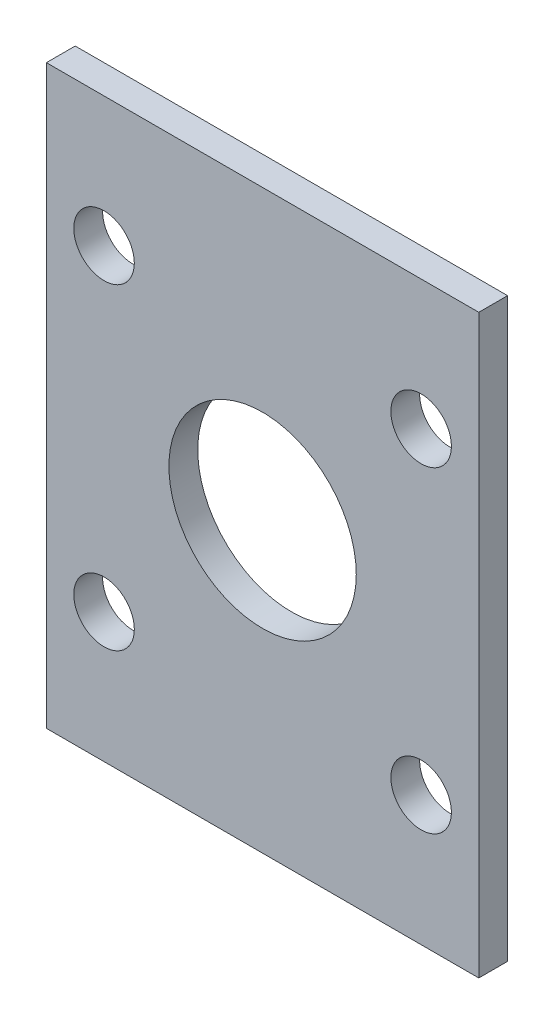
ISO-10303-21;
HEADER;
FILE_DESCRIPTION(('STEP AP214'),'2;1');
FILE_NAME('part.step','',(''),(''),'','','');
FILE_SCHEMA(('AUTOMOTIVE_DESIGN { 1 0 10303 214 1 1 1 1 }'));
ENDSEC;
DATA;
#1=APPLICATION_CONTEXT('core data for automotive mechanical design processes');
#2=APPLICATION_PROTOCOL_DEFINITION('international standard','automotive_design',2000,#1);
#3=PRODUCT_CONTEXT('',#1,'mechanical');
#4=PRODUCT('Part','Part','',(#3));
#5=PRODUCT_RELATED_PRODUCT_CATEGORY('part','',(#4));
#6=PRODUCT_DEFINITION_FORMATION('','',#4);
#7=PRODUCT_DEFINITION_CONTEXT('part definition',#1,'design');
#8=PRODUCT_DEFINITION('design','',#6,#7);
#9=PRODUCT_DEFINITION_SHAPE('','',#8);
#10=(LENGTH_UNIT() NAMED_UNIT(*) SI_UNIT(.MILLI.,.METRE.));
#11=(NAMED_UNIT(*) PLANE_ANGLE_UNIT() SI_UNIT($,.RADIAN.));
#12=(NAMED_UNIT(*) SI_UNIT($,.STERADIAN.) SOLID_ANGLE_UNIT());
#13=UNCERTAINTY_MEASURE_WITH_UNIT(LENGTH_MEASURE(1.E-05),#10,'distance_accuracy_value','');
#14=(GEOMETRIC_REPRESENTATION_CONTEXT(3) GLOBAL_UNCERTAINTY_ASSIGNED_CONTEXT((#13)) GLOBAL_UNIT_ASSIGNED_CONTEXT((#10,
#11,#12)) REPRESENTATION_CONTEXT('',''));
#15=CARTESIAN_POINT('',(0.,0.,0.));
#16=DIRECTION('',(0.,0.,1.));
#17=DIRECTION('',(1.,0.,0.));
#18=AXIS2_PLACEMENT_3D('',#15,#16,#17);
#19=CARTESIAN_POINT('',(-15.,0.,2.));
#20=DIRECTION('',(1.,0.,0.));
#21=DIRECTION('',(0.,1.,0.));
#22=AXIS2_PLACEMENT_3D('',#19,#20,#21);
#23=PLANE('',#22);
#24=DIRECTION('',(0.,-1.,0.));
#25=VECTOR('',#24,1.);
#26=CARTESIAN_POINT('',(-15.,0.,0.));
#27=LINE('',#26,#25);
#28=CARTESIAN_POINT('',(-15.,20.,0.));
#29=VERTEX_POINT('',#28);
#30=CARTESIAN_POINT('',(-15.,-20.,0.));
#31=VERTEX_POINT('',#30);
#32=EDGE_CURVE('E59',#29,#31,#27,.T.);
#33=ORIENTED_EDGE('',*,*,#32,.T.);
#34=DIRECTION('',(0.,0.,-1.));
#35=VECTOR('',#34,1.);
#36=CARTESIAN_POINT('',(-15.,-20.,0.));
#37=LINE('',#36,#35);
#38=CARTESIAN_POINT('',(-15.,-20.,2.));
#39=VERTEX_POINT('',#38);
#40=EDGE_CURVE('E86',#39,#31,#37,.T.);
#41=ORIENTED_EDGE('',*,*,#40,.F.);
#42=DIRECTION('',(0.,-1.,0.));
#43=VECTOR('',#42,1.);
#44=CARTESIAN_POINT('',(-15.,0.,2.));
#45=LINE('',#44,#43);
#46=CARTESIAN_POINT('',(-15.,20.,2.));
#47=VERTEX_POINT('',#46);
#48=EDGE_CURVE('E51',#47,#39,#45,.T.);
#49=ORIENTED_EDGE('',*,*,#48,.F.);
#50=DIRECTION('',(0.,0.,1.));
#51=VECTOR('',#50,1.);
#52=CARTESIAN_POINT('',(-15.,20.,0.));
#53=LINE('',#52,#51);
#54=EDGE_CURVE('E88',#29,#47,#53,.T.);
#55=ORIENTED_EDGE('',*,*,#54,.F.);
#56=EDGE_LOOP('',(#33,#41,#49,#55));
#57=FACE_BOUND('',#56,.T.);
#58=ADVANCED_FACE('F41',(#57),#23,.F.);
#59=CARTESIAN_POINT('',(15.,0.,2.));
#60=DIRECTION('',(1.,0.,0.));
#61=DIRECTION('',(0.,1.,0.));
#62=AXIS2_PLACEMENT_3D('',#59,#60,#61);
#63=PLANE('',#62);
#64=DIRECTION('',(0.,-1.,0.));
#65=VECTOR('',#64,1.);
#66=CARTESIAN_POINT('',(15.,0.,0.));
#67=LINE('',#66,#65);
#68=CARTESIAN_POINT('',(15.,20.,0.));
#69=VERTEX_POINT('',#68);
#70=CARTESIAN_POINT('',(15.,-20.,0.));
#71=VERTEX_POINT('',#70);
#72=EDGE_CURVE('E45',#69,#71,#67,.T.);
#73=ORIENTED_EDGE('',*,*,#72,.F.);
#74=DIRECTION('',(0.,0.,-1.));
#75=VECTOR('',#74,1.);
#76=CARTESIAN_POINT('',(15.,20.,0.));
#77=LINE('',#76,#75);
#78=CARTESIAN_POINT('',(15.,20.,2.));
#79=VERTEX_POINT('',#78);
#80=EDGE_CURVE('E116',#79,#69,#77,.T.);
#81=ORIENTED_EDGE('',*,*,#80,.F.);
#82=DIRECTION('',(0.,-1.,0.));
#83=VECTOR('',#82,1.);
#84=CARTESIAN_POINT('',(15.,0.,2.));
#85=LINE('',#84,#83);
#86=CARTESIAN_POINT('',(15.,-20.,2.));
#87=VERTEX_POINT('',#86);
#88=EDGE_CURVE('E11',#79,#87,#85,.T.);
#89=ORIENTED_EDGE('',*,*,#88,.T.);
#90=DIRECTION('',(0.,0.,1.));
#91=VECTOR('',#90,1.);
#92=CARTESIAN_POINT('',(15.,-20.,0.));
#93=LINE('',#92,#91);
#94=EDGE_CURVE('E97',#71,#87,#93,.T.);
#95=ORIENTED_EDGE('',*,*,#94,.F.);
#96=EDGE_LOOP('',(#73,#81,#89,#95));
#97=FACE_BOUND('',#96,.T.);
#98=ADVANCED_FACE('F168',(#97),#63,.T.);
#99=CARTESIAN_POINT('',(-11.,11.,2.));
#100=DIRECTION('',(0.,0.,-1.));
#101=DIRECTION('',(-1.,0.,0.));
#102=AXIS2_PLACEMENT_3D('',#99,#100,#101);
#103=CYLINDRICAL_SURFACE('',#102,2.1);
#104=CARTESIAN_POINT('',(-11.,11.,2.));
#105=DIRECTION('',(0.,0.,1.));
#106=DIRECTION('',(1.,0.,0.));
#107=AXIS2_PLACEMENT_3D('',#104,#105,#106);
#108=CIRCLE('',#107,2.1);
#109=CARTESIAN_POINT('',(-8.9,11.,2.));
#110=VERTEX_POINT('',#109);
#111=EDGE_CURVE('E143',#110,#110,#108,.T.);
#112=ORIENTED_EDGE('',*,*,#111,.T.);
#113=EDGE_LOOP('',(#112));
#114=FACE_BOUND('',#113,.T.);
#115=CARTESIAN_POINT('',(-11.,11.,0.));
#116=DIRECTION('',(0.,0.,1.));
#117=DIRECTION('',(1.,0.,0.));
#118=AXIS2_PLACEMENT_3D('',#115,#116,#117);
#119=CIRCLE('',#118,2.1);
#120=CARTESIAN_POINT('',(-8.9,11.,0.));
#121=VERTEX_POINT('',#120);
#122=EDGE_CURVE('E90',#121,#121,#119,.T.);
#123=ORIENTED_EDGE('',*,*,#122,.F.);
#124=EDGE_LOOP('',(#123));
#125=FACE_BOUND('',#124,.T.);
#126=ADVANCED_FACE('F165',(#114,#125),#103,.F.);
#127=CARTESIAN_POINT('',(11.,11.,2.));
#128=DIRECTION('',(0.,0.,-1.));
#129=DIRECTION('',(-1.,0.,0.));
#130=AXIS2_PLACEMENT_3D('',#127,#128,#129);
#131=CYLINDRICAL_SURFACE('',#130,2.1);
#132=CARTESIAN_POINT('',(11.,11.,2.));
#133=DIRECTION('',(0.,0.,1.));
#134=DIRECTION('',(1.,0.,0.));
#135=AXIS2_PLACEMENT_3D('',#132,#133,#134);
#136=CIRCLE('',#135,2.1);
#137=CARTESIAN_POINT('',(13.1,11.,2.));
#138=VERTEX_POINT('',#137);
#139=EDGE_CURVE('E139',#138,#138,#136,.T.);
#140=ORIENTED_EDGE('',*,*,#139,.T.);
#141=EDGE_LOOP('',(#140));
#142=FACE_BOUND('',#141,.T.);
#143=CARTESIAN_POINT('',(11.,11.,0.));
#144=DIRECTION('',(0.,0.,1.));
#145=DIRECTION('',(1.,0.,0.));
#146=AXIS2_PLACEMENT_3D('',#143,#144,#145);
#147=CIRCLE('',#146,2.1);
#148=CARTESIAN_POINT('',(13.1,11.,0.));
#149=VERTEX_POINT('',#148);
#150=EDGE_CURVE('E156',#149,#149,#147,.T.);
#151=ORIENTED_EDGE('',*,*,#150,.F.);
#152=EDGE_LOOP('',(#151));
#153=FACE_BOUND('',#152,.T.);
#154=ADVANCED_FACE('F167',(#142,#153),#131,.F.);
#155=CARTESIAN_POINT('',(11.,-11.,2.));
#156=DIRECTION('',(0.,0.,-1.));
#157=DIRECTION('',(-1.,0.,0.));
#158=AXIS2_PLACEMENT_3D('',#155,#156,#157);
#159=CYLINDRICAL_SURFACE('',#158,2.1);
#160=CARTESIAN_POINT('',(11.,-11.,2.));
#161=DIRECTION('',(0.,0.,1.));
#162=DIRECTION('',(1.,0.,0.));
#163=AXIS2_PLACEMENT_3D('',#160,#161,#162);
#164=CIRCLE('',#163,2.1);
#165=CARTESIAN_POINT('',(13.1,-11.,2.));
#166=VERTEX_POINT('',#165);
#167=EDGE_CURVE('E135',#166,#166,#164,.T.);
#168=ORIENTED_EDGE('',*,*,#167,.T.);
#169=EDGE_LOOP('',(#168));
#170=FACE_BOUND('',#169,.T.);
#171=CARTESIAN_POINT('',(11.,-11.,0.));
#172=DIRECTION('',(0.,0.,1.));
#173=DIRECTION('',(1.,0.,0.));
#174=AXIS2_PLACEMENT_3D('',#171,#172,#173);
#175=CIRCLE('',#174,2.1);
#176=CARTESIAN_POINT('',(13.1,-11.,0.));
#177=VERTEX_POINT('',#176);
#178=EDGE_CURVE('E152',#177,#177,#175,.T.);
#179=ORIENTED_EDGE('',*,*,#178,.F.);
#180=EDGE_LOOP('',(#179));
#181=FACE_BOUND('',#180,.T.);
#182=ADVANCED_FACE('F175',(#170,#181),#159,.F.);
#183=CARTESIAN_POINT('',(-11.,-11.,2.));
#184=DIRECTION('',(0.,0.,-1.));
#185=DIRECTION('',(-1.,0.,0.));
#186=AXIS2_PLACEMENT_3D('',#183,#184,#185);
#187=CYLINDRICAL_SURFACE('',#186,2.1);
#188=CARTESIAN_POINT('',(-11.,-11.,2.));
#189=DIRECTION('',(0.,0.,1.));
#190=DIRECTION('',(1.,0.,0.));
#191=AXIS2_PLACEMENT_3D('',#188,#189,#190);
#192=CIRCLE('',#191,2.1);
#193=CARTESIAN_POINT('',(-8.9,-11.,2.));
#194=VERTEX_POINT('',#193);
#195=EDGE_CURVE('E131',#194,#194,#192,.T.);
#196=ORIENTED_EDGE('',*,*,#195,.T.);
#197=EDGE_LOOP('',(#196));
#198=FACE_BOUND('',#197,.T.);
#199=CARTESIAN_POINT('',(-11.,-11.,0.));
#200=DIRECTION('',(0.,0.,1.));
#201=DIRECTION('',(1.,0.,0.));
#202=AXIS2_PLACEMENT_3D('',#199,#200,#201);
#203=CIRCLE('',#202,2.1);
#204=CARTESIAN_POINT('',(-8.9,-11.,0.));
#205=VERTEX_POINT('',#204);
#206=EDGE_CURVE('E127',#205,#205,#203,.T.);
#207=ORIENTED_EDGE('',*,*,#206,.F.);
#208=EDGE_LOOP('',(#207));
#209=FACE_BOUND('',#208,.T.);
#210=ADVANCED_FACE('F43',(#198,#209),#187,.F.);
#211=CARTESIAN_POINT('',(0.,0.,2.));
#212=DIRECTION('',(0.,0.,1.));
#213=DIRECTION('',(1.,0.,0.));
#214=AXIS2_PLACEMENT_3D('',#211,#212,#213);
#215=PLANE('',#214);
#216=CARTESIAN_POINT('',(0.,0.,2.));
#217=DIRECTION('',(0.,0.,1.));
#218=DIRECTION('',(1.,0.,0.));
#219=AXIS2_PLACEMENT_3D('',#216,#217,#218);
#220=CIRCLE('',#219,6.5);
#221=CARTESIAN_POINT('',(6.5,0.,2.));
#222=VERTEX_POINT('',#221);
#223=EDGE_CURVE('E122',#222,#222,#220,.T.);
#224=ORIENTED_EDGE('',*,*,#223,.F.);
#225=EDGE_LOOP('',(#224));
#226=FACE_BOUND('',#225,.T.);
#227=ORIENTED_EDGE('',*,*,#195,.F.);
#228=EDGE_LOOP('',(#227));
#229=FACE_BOUND('',#228,.T.);
#230=ORIENTED_EDGE('',*,*,#167,.F.);
#231=EDGE_LOOP('',(#230));
#232=FACE_BOUND('',#231,.T.);
#233=ORIENTED_EDGE('',*,*,#139,.F.);
#234=EDGE_LOOP('',(#233));
#235=FACE_BOUND('',#234,.T.);
#236=ORIENTED_EDGE('',*,*,#111,.F.);
#237=EDGE_LOOP('',(#236));
#238=FACE_BOUND('',#237,.T.);
#239=ORIENTED_EDGE('',*,*,#48,.T.);
#240=DIRECTION('',(-1.,0.,0.));
#241=VECTOR('',#240,1.);
#242=CARTESIAN_POINT('',(-15.,-20.,2.));
#243=LINE('',#242,#241);
#244=EDGE_CURVE('E102',#87,#39,#243,.T.);
#245=ORIENTED_EDGE('',*,*,#244,.F.);
#246=ORIENTED_EDGE('',*,*,#88,.F.);
#247=DIRECTION('',(1.,0.,0.));
#248=VECTOR('',#247,1.);
#249=CARTESIAN_POINT('',(-15.,20.,2.));
#250=LINE('',#249,#248);
#251=EDGE_CURVE('E112',#47,#79,#250,.T.);
#252=ORIENTED_EDGE('',*,*,#251,.F.);
#253=EDGE_LOOP('',(#239,#245,#246,#252));
#254=FACE_BOUND('',#253,.T.);
#255=ADVANCED_FACE('F187',(#226,#229,#232,#235,#238,#254),#215,.T.);
#256=CARTESIAN_POINT('',(0.,0.,0.));
#257=DIRECTION('',(0.,0.,1.));
#258=DIRECTION('',(1.,0.,0.));
#259=AXIS2_PLACEMENT_3D('',#256,#257,#258);
#260=PLANE('',#259);
#261=CARTESIAN_POINT('',(0.,0.,0.));
#262=DIRECTION('',(0.,0.,1.));
#263=DIRECTION('',(1.,0.,0.));
#264=AXIS2_PLACEMENT_3D('',#261,#262,#263);
#265=CIRCLE('',#264,6.5);
#266=CARTESIAN_POINT('',(6.5,0.,0.));
#267=VERTEX_POINT('',#266);
#268=EDGE_CURVE('E123',#267,#267,#265,.T.);
#269=ORIENTED_EDGE('',*,*,#268,.T.);
#270=EDGE_LOOP('',(#269));
#271=FACE_BOUND('',#270,.T.);
#272=ORIENTED_EDGE('',*,*,#206,.T.);
#273=EDGE_LOOP('',(#272));
#274=FACE_BOUND('',#273,.T.);
#275=ORIENTED_EDGE('',*,*,#178,.T.);
#276=EDGE_LOOP('',(#275));
#277=FACE_BOUND('',#276,.T.);
#278=ORIENTED_EDGE('',*,*,#150,.T.);
#279=EDGE_LOOP('',(#278));
#280=FACE_BOUND('',#279,.T.);
#281=ORIENTED_EDGE('',*,*,#122,.T.);
#282=EDGE_LOOP('',(#281));
#283=FACE_BOUND('',#282,.T.);
#284=ORIENTED_EDGE('',*,*,#32,.F.);
#285=DIRECTION('',(-1.,0.,0.));
#286=VECTOR('',#285,1.);
#287=CARTESIAN_POINT('',(-15.,20.,0.));
#288=LINE('',#287,#286);
#289=EDGE_CURVE('E119',#69,#29,#288,.T.);
#290=ORIENTED_EDGE('',*,*,#289,.F.);
#291=ORIENTED_EDGE('',*,*,#72,.T.);
#292=DIRECTION('',(1.,0.,0.));
#293=VECTOR('',#292,1.);
#294=CARTESIAN_POINT('',(-15.,-20.,0.));
#295=LINE('',#294,#293);
#296=EDGE_CURVE('E92',#31,#71,#295,.T.);
#297=ORIENTED_EDGE('',*,*,#296,.F.);
#298=EDGE_LOOP('',(#284,#290,#291,#297));
#299=FACE_BOUND('',#298,.T.);
#300=ADVANCED_FACE('F93',(#271,#274,#277,#280,#283,#299),#260,.F.);
#301=CARTESIAN_POINT('',(0.,0.,0.));
#302=DIRECTION('',(0.,0.,1.));
#303=DIRECTION('',(1.,0.,0.));
#304=AXIS2_PLACEMENT_3D('',#301,#302,#303);
#305=CYLINDRICAL_SURFACE('',#304,6.5);
#306=ORIENTED_EDGE('',*,*,#268,.F.);
#307=EDGE_LOOP('',(#306));
#308=FACE_BOUND('',#307,.T.);
#309=ORIENTED_EDGE('',*,*,#223,.T.);
#310=EDGE_LOOP('',(#309));
#311=FACE_BOUND('',#310,.T.);
#312=ADVANCED_FACE('F186',(#308,#311),#305,.F.);
#313=CARTESIAN_POINT('',(0.,20.,0.));
#314=DIRECTION('',(0.,1.,0.));
#315=DIRECTION('',(0.,0.,1.));
#316=AXIS2_PLACEMENT_3D('',#313,#314,#315);
#317=PLANE('',#316);
#318=ORIENTED_EDGE('',*,*,#54,.T.);
#319=ORIENTED_EDGE('',*,*,#251,.T.);
#320=ORIENTED_EDGE('',*,*,#80,.T.);
#321=ORIENTED_EDGE('',*,*,#289,.T.);
#322=EDGE_LOOP('',(#318,#319,#320,#321));
#323=FACE_BOUND('',#322,.T.);
#324=ADVANCED_FACE('F194',(#323),#317,.T.);
#325=CARTESIAN_POINT('',(0.,-20.,0.));
#326=DIRECTION('',(0.,1.,0.));
#327=DIRECTION('',(0.,0.,1.));
#328=AXIS2_PLACEMENT_3D('',#325,#326,#327);
#329=PLANE('',#328);
#330=ORIENTED_EDGE('',*,*,#40,.T.);
#331=ORIENTED_EDGE('',*,*,#296,.T.);
#332=ORIENTED_EDGE('',*,*,#94,.T.);
#333=ORIENTED_EDGE('',*,*,#244,.T.);
#334=EDGE_LOOP('',(#330,#331,#332,#333));
#335=FACE_BOUND('',#334,.T.);
#336=ADVANCED_FACE('F100',(#335),#329,.F.);
#337=CLOSED_SHELL('',(#58,#98,#126,#154,#182,#210,#255,#300,#312,#324,#336));
#338=MANIFOLD_SOLID_BREP('B2',#337);
#339=ADVANCED_BREP_SHAPE_REPRESENTATION('',(#18,#338),#14);
#340=SHAPE_DEFINITION_REPRESENTATION(#9,#339);
ENDSEC;
END-ISO-10303-21;
